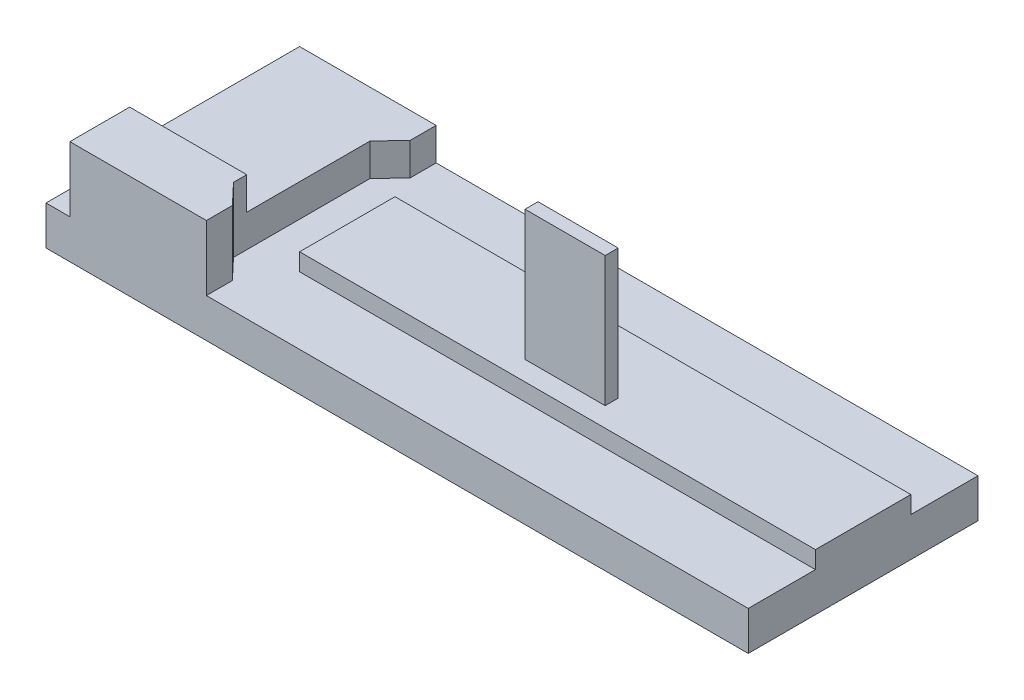
ISO-10303-21;
HEADER;
FILE_DESCRIPTION(('STEP AP214'),'2;1');
FILE_NAME('part.step','',(''),(''),'','','');
FILE_SCHEMA(('AUTOMOTIVE_DESIGN { 1 0 10303 214 1 1 1 1 }'));
ENDSEC;
DATA;
#1=APPLICATION_CONTEXT('core data for automotive mechanical design processes');
#2=APPLICATION_PROTOCOL_DEFINITION('international standard','automotive_design',2000,#1);
#3=PRODUCT_CONTEXT('',#1,'mechanical');
#4=PRODUCT('Part','Part','',(#3));
#5=PRODUCT_RELATED_PRODUCT_CATEGORY('part','',(#4));
#6=PRODUCT_DEFINITION_FORMATION('','',#4);
#7=PRODUCT_DEFINITION_CONTEXT('part definition',#1,'design');
#8=PRODUCT_DEFINITION('design','',#6,#7);
#9=PRODUCT_DEFINITION_SHAPE('','',#8);
#10=(LENGTH_UNIT() NAMED_UNIT(*) SI_UNIT(.MILLI.,.METRE.));
#11=(NAMED_UNIT(*) PLANE_ANGLE_UNIT() SI_UNIT($,.RADIAN.));
#12=(NAMED_UNIT(*) SI_UNIT($,.STERADIAN.) SOLID_ANGLE_UNIT());
#13=UNCERTAINTY_MEASURE_WITH_UNIT(LENGTH_MEASURE(1.E-05),#10,'distance_accuracy_value','');
#14=(GEOMETRIC_REPRESENTATION_CONTEXT(3) GLOBAL_UNCERTAINTY_ASSIGNED_CONTEXT((#13)) GLOBAL_UNIT_ASSIGNED_CONTEXT((#10,
#11,#12)) REPRESENTATION_CONTEXT('',''));
#15=CARTESIAN_POINT('',(0.,0.,0.));
#16=DIRECTION('',(0.,0.,1.));
#17=DIRECTION('',(1.,0.,0.));
#18=AXIS2_PLACEMENT_3D('',#15,#16,#17);
#19=CARTESIAN_POINT('',(0.,13.,0.));
#20=DIRECTION('',(0.,-1.,0.));
#21=DIRECTION('',(0.,0.,-1.));
#22=AXIS2_PLACEMENT_3D('',#19,#20,#21);
#23=PLANE('',#22);
#24=DIRECTION('',(0.,0.,-1.));
#25=VECTOR('',#24,1.);
#26=CARTESIAN_POINT('',(81.,13.,-11.));
#27=LINE('',#26,#25);
#28=CARTESIAN_POINT('',(81.,13.,11.));
#29=VERTEX_POINT('',#28);
#30=CARTESIAN_POINT('',(81.,13.,-11.));
#31=VERTEX_POINT('',#30);
#32=EDGE_CURVE('E230',#29,#31,#27,.T.);
#33=ORIENTED_EDGE('',*,*,#32,.T.);
#34=DIRECTION('',(-1.,0.,0.));
#35=VECTOR('',#34,1.);
#36=CARTESIAN_POINT('',(81.,13.,-11.));
#37=LINE('',#36,#35);
#38=CARTESIAN_POINT('',(-38.,13.,-11.));
#39=VERTEX_POINT('',#38);
#40=EDGE_CURVE('E234',#31,#39,#37,.T.);
#41=ORIENTED_EDGE('',*,*,#40,.T.);
#42=DIRECTION('',(0.,0.,1.));
#43=VECTOR('',#42,1.);
#44=CARTESIAN_POINT('',(-38.,13.,-11.));
#45=LINE('',#44,#43);
#46=CARTESIAN_POINT('',(-38.,13.,11.));
#47=VERTEX_POINT('',#46);
#48=EDGE_CURVE('E238',#39,#47,#45,.T.);
#49=ORIENTED_EDGE('',*,*,#48,.T.);
#50=DIRECTION('',(1.,0.,0.));
#51=VECTOR('',#50,1.);
#52=CARTESIAN_POINT('',(81.,13.,11.));
#53=LINE('',#52,#51);
#54=EDGE_CURVE('E241',#47,#29,#53,.T.);
#55=ORIENTED_EDGE('',*,*,#54,.T.);
#56=EDGE_LOOP('',(#33,#41,#49,#55));
#57=FACE_BOUND('',#56,.T.);
#58=DIRECTION('',(0.,0.,1.));
#59=VECTOR('',#58,1.);
#60=CARTESIAN_POINT('',(9.50000000000002,13.,3.5));
#61=LINE('',#60,#59);
#62=CARTESIAN_POINT('',(9.50000000000002,13.,3.5));
#63=VERTEX_POINT('',#62);
#64=CARTESIAN_POINT('',(9.50000000000002,13.,6.5));
#65=VERTEX_POINT('',#64);
#66=EDGE_CURVE('E217',#63,#65,#61,.T.);
#67=ORIENTED_EDGE('',*,*,#66,.F.);
#68=DIRECTION('',(-1.,0.,0.));
#69=VECTOR('',#68,1.);
#70=CARTESIAN_POINT('',(9.50000000000002,13.,3.5));
#71=LINE('',#70,#69);
#72=CARTESIAN_POINT('',(28.,13.,3.5));
#73=VERTEX_POINT('',#72);
#74=EDGE_CURVE('E214',#73,#63,#71,.T.);
#75=ORIENTED_EDGE('',*,*,#74,.F.);
#76=DIRECTION('',(0.,0.,-1.));
#77=VECTOR('',#76,1.);
#78=CARTESIAN_POINT('',(28.,13.,3.5));
#79=LINE('',#78,#77);
#80=CARTESIAN_POINT('',(28.,13.,6.5));
#81=VERTEX_POINT('',#80);
#82=EDGE_CURVE('E66',#81,#73,#79,.T.);
#83=ORIENTED_EDGE('',*,*,#82,.F.);
#84=DIRECTION('',(1.,0.,0.));
#85=VECTOR('',#84,1.);
#86=CARTESIAN_POINT('',(9.50000000000002,13.,6.5));
#87=LINE('',#86,#85);
#88=EDGE_CURVE('E61',#65,#81,#87,.T.);
#89=ORIENTED_EDGE('',*,*,#88,.F.);
#90=EDGE_LOOP('',(#67,#75,#83,#89));
#91=FACE_BOUND('',#90,.T.);
#92=ADVANCED_FACE('F45',(#57,#91),#23,.F.);
#93=CARTESIAN_POINT('',(0.,9.,0.));
#94=DIRECTION('',(0.,-1.,0.));
#95=DIRECTION('',(0.,0.,-1.));
#96=AXIS2_PLACEMENT_3D('',#93,#94,#95);
#97=PLANE('',#96);
#98=DIRECTION('',(-1.,0.,0.));
#99=VECTOR('',#98,1.);
#100=CARTESIAN_POINT('',(81.,9.,-11.));
#101=LINE('',#100,#99);
#102=CARTESIAN_POINT('',(81.,9.,-11.));
#103=VERTEX_POINT('',#102);
#104=CARTESIAN_POINT('',(-38.,9.,-11.));
#105=VERTEX_POINT('',#104);
#106=EDGE_CURVE('E219',#103,#105,#101,.T.);
#107=ORIENTED_EDGE('',*,*,#106,.F.);
#108=DIRECTION('',(0.,0.,-1.));
#109=VECTOR('',#108,1.);
#110=CARTESIAN_POINT('',(81.,9.,26.5));
#111=LINE('',#110,#109);
#112=CARTESIAN_POINT('',(81.,9.,-26.5));
#113=VERTEX_POINT('',#112);
#114=EDGE_CURVE('E372',#103,#113,#111,.T.);
#115=ORIENTED_EDGE('',*,*,#114,.T.);
#116=DIRECTION('',(-1.,0.,0.));
#117=VECTOR('',#116,1.);
#118=CARTESIAN_POINT('',(-81.,9.,-26.5));
#119=LINE('',#118,#117);
#120=CARTESIAN_POINT('',(-44.,9.,-26.5));
#121=VERTEX_POINT('',#120);
#122=EDGE_CURVE('E373',#113,#121,#119,.T.);
#123=ORIENTED_EDGE('',*,*,#122,.T.);
#124=DIRECTION('',(0.,0.,-1.));
#125=VECTOR('',#124,1.);
#126=CARTESIAN_POINT('',(-44.,9.,-20.5));
#127=LINE('',#126,#125);
#128=CARTESIAN_POINT('',(-44.,9.,-20.5));
#129=VERTEX_POINT('',#128);
#130=EDGE_CURVE('E304',#129,#121,#127,.T.);
#131=ORIENTED_EDGE('',*,*,#130,.F.);
#132=DIRECTION('',(0.687744647910783,0.,-0.725952683905827));
#133=VECTOR('',#132,1.);
#134=CARTESIAN_POINT('',(-48.5,9.,-15.75));
#135=LINE('',#134,#133);
#136=CARTESIAN_POINT('',(-48.5,9.,-15.75));
#137=VERTEX_POINT('',#136);
#138=EDGE_CURVE('E333',#137,#129,#135,.T.);
#139=ORIENTED_EDGE('',*,*,#138,.F.);
#140=DIRECTION('',(0.,0.,-1.));
#141=VECTOR('',#140,1.);
#142=CARTESIAN_POINT('',(-48.5,9.,15.75));
#143=LINE('',#142,#141);
#144=CARTESIAN_POINT('',(-48.5,9.,15.75));
#145=VERTEX_POINT('',#144);
#146=EDGE_CURVE('E329',#145,#137,#143,.T.);
#147=ORIENTED_EDGE('',*,*,#146,.F.);
#148=DIRECTION('',(-0.687744647910783,0.,-0.725952683905827));
#149=VECTOR('',#148,1.);
#150=CARTESIAN_POINT('',(-48.5,9.,15.75));
#151=LINE('',#150,#149);
#152=CARTESIAN_POINT('',(-44.,9.,20.5));
#153=VERTEX_POINT('',#152);
#154=EDGE_CURVE('E325',#153,#145,#151,.T.);
#155=ORIENTED_EDGE('',*,*,#154,.F.);
#156=DIRECTION('',(0.,0.,-1.));
#157=VECTOR('',#156,1.);
#158=CARTESIAN_POINT('',(-44.,9.,20.5));
#159=LINE('',#158,#157);
#160=CARTESIAN_POINT('',(-44.,9.,26.5));
#161=VERTEX_POINT('',#160);
#162=EDGE_CURVE('E321',#161,#153,#159,.T.);
#163=ORIENTED_EDGE('',*,*,#162,.F.);
#164=DIRECTION('',(1.,0.,0.));
#165=VECTOR('',#164,1.);
#166=CARTESIAN_POINT('',(-81.,9.,26.5));
#167=LINE('',#166,#165);
#168=CARTESIAN_POINT('',(81.,9.,26.5));
#169=VERTEX_POINT('',#168);
#170=EDGE_CURVE('E380',#161,#169,#167,.T.);
#171=ORIENTED_EDGE('',*,*,#170,.T.);
#172=CARTESIAN_POINT('',(81.,9.,11.));
#173=VERTEX_POINT('',#172);
#174=EDGE_CURVE('E368',#169,#173,#111,.T.);
#175=ORIENTED_EDGE('',*,*,#174,.T.);
#176=DIRECTION('',(1.,0.,0.));
#177=VECTOR('',#176,1.);
#178=CARTESIAN_POINT('',(81.,9.,11.));
#179=LINE('',#178,#177);
#180=CARTESIAN_POINT('',(-38.,9.,11.));
#181=VERTEX_POINT('',#180);
#182=EDGE_CURVE('E235',#181,#173,#179,.T.);
#183=ORIENTED_EDGE('',*,*,#182,.F.);
#184=DIRECTION('',(0.,0.,1.));
#185=VECTOR('',#184,1.);
#186=CARTESIAN_POINT('',(-38.,9.,-11.));
#187=LINE('',#186,#185);
#188=EDGE_CURVE('E224',#105,#181,#187,.T.);
#189=ORIENTED_EDGE('',*,*,#188,.F.);
#190=EDGE_LOOP('',(#107,#115,#123,#131,#139,#147,#155,#163,#171,#175,#183,#189));
#191=FACE_BOUND('',#190,.T.);
#192=ADVANCED_FACE('F433',(#191),#97,.F.);
#193=DIRECTION('',(0.,0.,1.));
#194=VECTOR('',#193,1.);
#195=CARTESIAN_POINT('',(-75.5,9.,-26.5));
#196=LINE('',#195,#194);
#197=CARTESIAN_POINT('',(-75.5,9.,-26.5));
#198=VERTEX_POINT('',#197);
#199=CARTESIAN_POINT('',(-75.5,9.,26.5));
#200=VERTEX_POINT('',#199);
#201=EDGE_CURVE('E299',#198,#200,#196,.T.);
#202=ORIENTED_EDGE('',*,*,#201,.F.);
#203=CARTESIAN_POINT('',(-81.,9.,-26.5));
#204=VERTEX_POINT('',#203);
#205=EDGE_CURVE('E371',#198,#204,#119,.T.);
#206=ORIENTED_EDGE('',*,*,#205,.T.);
#207=DIRECTION('',(0.,0.,1.));
#208=VECTOR('',#207,1.);
#209=CARTESIAN_POINT('',(-81.,9.,26.5));
#210=LINE('',#209,#208);
#211=CARTESIAN_POINT('',(-81.,9.,26.5));
#212=VERTEX_POINT('',#211);
#213=EDGE_CURVE('E377',#204,#212,#210,.T.);
#214=ORIENTED_EDGE('',*,*,#213,.T.);
#215=EDGE_CURVE('E381',#212,#200,#167,.T.);
#216=ORIENTED_EDGE('',*,*,#215,.T.);
#217=EDGE_LOOP('',(#202,#206,#214,#216));
#218=FACE_BOUND('',#217,.T.);
#219=ADVANCED_FACE('F551',(#218),#97,.F.);
#220=CARTESIAN_POINT('',(81.,9.,26.5));
#221=DIRECTION('',(-1.,0.,0.));
#222=DIRECTION('',(0.,0.,1.));
#223=AXIS2_PLACEMENT_3D('',#220,#221,#222);
#224=PLANE('',#223);
#225=DIRECTION('',(0.,0.,-1.));
#226=VECTOR('',#225,1.);
#227=CARTESIAN_POINT('',(81.,0.,26.5));
#228=LINE('',#227,#226);
#229=CARTESIAN_POINT('',(81.,0.,26.5));
#230=VERTEX_POINT('',#229);
#231=CARTESIAN_POINT('',(81.,0.,-26.5));
#232=VERTEX_POINT('',#231);
#233=EDGE_CURVE('E367',#230,#232,#228,.T.);
#234=ORIENTED_EDGE('',*,*,#233,.T.);
#235=DIRECTION('',(0.,-1.,0.));
#236=VECTOR('',#235,1.);
#237=CARTESIAN_POINT('',(81.,9.,-26.5));
#238=LINE('',#237,#236);
#239=EDGE_CURVE('E408',#113,#232,#238,.T.);
#240=ORIENTED_EDGE('',*,*,#239,.F.);
#241=ORIENTED_EDGE('',*,*,#114,.F.);
#242=DIRECTION('',(0.,-1.,0.));
#243=VECTOR('',#242,1.);
#244=CARTESIAN_POINT('',(81.,13.,-11.));
#245=LINE('',#244,#243);
#246=EDGE_CURVE('E262',#31,#103,#245,.T.);
#247=ORIENTED_EDGE('',*,*,#246,.F.);
#248=ORIENTED_EDGE('',*,*,#32,.F.);
#249=DIRECTION('',(0.,-1.,0.));
#250=VECTOR('',#249,1.);
#251=CARTESIAN_POINT('',(81.,13.,11.));
#252=LINE('',#251,#250);
#253=EDGE_CURVE('E243',#29,#173,#252,.T.);
#254=ORIENTED_EDGE('',*,*,#253,.T.);
#255=ORIENTED_EDGE('',*,*,#174,.F.);
#256=DIRECTION('',(0.,-1.,0.));
#257=VECTOR('',#256,1.);
#258=CARTESIAN_POINT('',(81.,9.,26.5));
#259=LINE('',#258,#257);
#260=EDGE_CURVE('E384',#169,#230,#259,.T.);
#261=ORIENTED_EDGE('',*,*,#260,.T.);
#262=EDGE_LOOP('',(#234,#240,#241,#247,#248,#254,#255,#261));
#263=FACE_BOUND('',#262,.T.);
#264=ADVANCED_FACE('F47',(#263),#224,.F.);
#265=CARTESIAN_POINT('',(-81.,9.,-26.5));
#266=DIRECTION('',(0.,0.,1.));
#267=DIRECTION('',(1.,0.,0.));
#268=AXIS2_PLACEMENT_3D('',#265,#266,#267);
#269=PLANE('',#268);
#270=DIRECTION('',(0.,-1.,0.));
#271=VECTOR('',#270,1.);
#272=CARTESIAN_POINT('',(-75.5,24.,-26.5));
#273=LINE('',#272,#271);
#274=CARTESIAN_POINT('',(-75.5,16.5,-26.5));
#275=VERTEX_POINT('',#274);
#276=EDGE_CURVE('E364',#275,#198,#273,.T.);
#277=ORIENTED_EDGE('',*,*,#276,.F.);
#278=DIRECTION('',(-1.,0.,0.));
#279=VECTOR('',#278,1.);
#280=CARTESIAN_POINT('',(81.,16.5,-26.5));
#281=LINE('',#280,#279);
#282=CARTESIAN_POINT('',(-44.,16.5,-26.5));
#283=VERTEX_POINT('',#282);
#284=EDGE_CURVE('E281',#283,#275,#281,.T.);
#285=ORIENTED_EDGE('',*,*,#284,.F.);
#286=DIRECTION('',(0.,-1.,0.));
#287=VECTOR('',#286,1.);
#288=CARTESIAN_POINT('',(-44.,24.,-26.5));
#289=LINE('',#288,#287);
#290=EDGE_CURVE('E317',#283,#121,#289,.T.);
#291=ORIENTED_EDGE('',*,*,#290,.T.);
#292=ORIENTED_EDGE('',*,*,#122,.F.);
#293=ORIENTED_EDGE('',*,*,#239,.T.);
#294=DIRECTION('',(-1.,0.,0.));
#295=VECTOR('',#294,1.);
#296=CARTESIAN_POINT('',(-81.,0.,-26.5));
#297=LINE('',#296,#295);
#298=CARTESIAN_POINT('',(-81.,0.,-26.5));
#299=VERTEX_POINT('',#298);
#300=EDGE_CURVE('E388',#232,#299,#297,.T.);
#301=ORIENTED_EDGE('',*,*,#300,.T.);
#302=DIRECTION('',(0.,-1.,0.));
#303=VECTOR('',#302,1.);
#304=CARTESIAN_POINT('',(-81.,9.,-26.5));
#305=LINE('',#304,#303);
#306=EDGE_CURVE('E404',#204,#299,#305,.T.);
#307=ORIENTED_EDGE('',*,*,#306,.F.);
#308=ORIENTED_EDGE('',*,*,#205,.F.);
#309=EDGE_LOOP('',(#277,#285,#291,#292,#293,#301,#307,#308));
#310=FACE_BOUND('',#309,.T.);
#311=ADVANCED_FACE('F447',(#310),#269,.F.);
#312=CARTESIAN_POINT('',(-81.,9.,26.5));
#313=DIRECTION('',(1.,0.,0.));
#314=DIRECTION('',(0.,0.,-1.));
#315=AXIS2_PLACEMENT_3D('',#312,#313,#314);
#316=PLANE('',#315);
#317=DIRECTION('',(0.,0.,1.));
#318=VECTOR('',#317,1.);
#319=CARTESIAN_POINT('',(-81.,0.,26.5));
#320=LINE('',#319,#318);
#321=CARTESIAN_POINT('',(-81.,0.,26.5));
#322=VERTEX_POINT('',#321);
#323=EDGE_CURVE('E391',#299,#322,#320,.T.);
#324=ORIENTED_EDGE('',*,*,#323,.T.);
#325=DIRECTION('',(0.,-1.,0.));
#326=VECTOR('',#325,1.);
#327=CARTESIAN_POINT('',(-81.,9.,26.5));
#328=LINE('',#327,#326);
#329=EDGE_CURVE('E400',#212,#322,#328,.T.);
#330=ORIENTED_EDGE('',*,*,#329,.F.);
#331=ORIENTED_EDGE('',*,*,#213,.F.);
#332=ORIENTED_EDGE('',*,*,#306,.T.);
#333=EDGE_LOOP('',(#324,#330,#331,#332));
#334=FACE_BOUND('',#333,.T.);
#335=ADVANCED_FACE('F557',(#334),#316,.F.);
#336=CARTESIAN_POINT('',(-81.,9.,26.5));
#337=DIRECTION('',(0.,0.,-1.));
#338=DIRECTION('',(-1.,0.,0.));
#339=AXIS2_PLACEMENT_3D('',#336,#337,#338);
#340=PLANE('',#339);
#341=DIRECTION('',(1.,0.,0.));
#342=VECTOR('',#341,1.);
#343=CARTESIAN_POINT('',(-81.,0.,26.5));
#344=LINE('',#343,#342);
#345=EDGE_CURVE('E394',#322,#230,#344,.T.);
#346=ORIENTED_EDGE('',*,*,#345,.T.);
#347=ORIENTED_EDGE('',*,*,#260,.F.);
#348=ORIENTED_EDGE('',*,*,#170,.F.);
#349=DIRECTION('',(0.,-1.,0.));
#350=VECTOR('',#349,1.);
#351=CARTESIAN_POINT('',(-44.,24.,26.5));
#352=LINE('',#351,#350);
#353=CARTESIAN_POINT('',(-44.,24.,26.5));
#354=VERTEX_POINT('',#353);
#355=EDGE_CURVE('E356',#354,#161,#352,.T.);
#356=ORIENTED_EDGE('',*,*,#355,.F.);
#357=DIRECTION('',(1.,0.,0.));
#358=VECTOR('',#357,1.);
#359=CARTESIAN_POINT('',(-44.,24.,26.5));
#360=LINE('',#359,#358);
#361=CARTESIAN_POINT('',(-75.5,24.,26.5));
#362=VERTEX_POINT('',#361);
#363=EDGE_CURVE('E303',#362,#354,#360,.T.);
#364=ORIENTED_EDGE('',*,*,#363,.F.);
#365=DIRECTION('',(0.,-1.,0.));
#366=VECTOR('',#365,1.);
#367=CARTESIAN_POINT('',(-75.5,24.,26.5));
#368=LINE('',#367,#366);
#369=EDGE_CURVE('E360',#362,#200,#368,.T.);
#370=ORIENTED_EDGE('',*,*,#369,.T.);
#371=ORIENTED_EDGE('',*,*,#215,.F.);
#372=ORIENTED_EDGE('',*,*,#329,.T.);
#373=EDGE_LOOP('',(#346,#347,#348,#356,#364,#370,#371,#372));
#374=FACE_BOUND('',#373,.T.);
#375=ADVANCED_FACE('F459',(#374),#340,.F.);
#376=CARTESIAN_POINT('',(0.,0.,0.));
#377=DIRECTION('',(0.,-1.,0.));
#378=DIRECTION('',(0.,0.,-1.));
#379=AXIS2_PLACEMENT_3D('',#376,#377,#378);
#380=PLANE('',#379);
#381=ORIENTED_EDGE('',*,*,#233,.F.);
#382=ORIENTED_EDGE('',*,*,#345,.F.);
#383=ORIENTED_EDGE('',*,*,#323,.F.);
#384=ORIENTED_EDGE('',*,*,#300,.F.);
#385=EDGE_LOOP('',(#381,#382,#383,#384));
#386=FACE_BOUND('',#385,.T.);
#387=ADVANCED_FACE('F547',(#386),#380,.T.);
#388=CARTESIAN_POINT('',(-75.5,24.,-26.5));
#389=DIRECTION('',(1.,0.,0.));
#390=DIRECTION('',(0.,0.,-1.));
#391=AXIS2_PLACEMENT_3D('',#388,#389,#390);
#392=PLANE('',#391);
#393=CARTESIAN_POINT('',(-75.5,16.5175631474597,19.5984697974364));
#394=DIRECTION('',(-1.,0.,0.));
#395=DIRECTION('',(0.,0.,1.));
#396=AXIS2_PLACEMENT_3D('',#393,#394,#395);
#397=CIRCLE('',#396,3.25);
#398=CARTESIAN_POINT('',(-75.5,16.5175631474597,22.8484697974364));
#399=VERTEX_POINT('',#398);
#400=EDGE_CURVE('E266',#399,#399,#397,.T.);
#401=ORIENTED_EDGE('',*,*,#400,.F.);
#402=EDGE_LOOP('',(#401));
#403=FACE_BOUND('',#402,.T.);
#404=DIRECTION('',(0.,0.,1.));
#405=VECTOR('',#404,1.);
#406=CARTESIAN_POINT('',(-75.5,24.,-26.5));
#407=LINE('',#406,#405);
#408=CARTESIAN_POINT('',(-75.5,24.,12.6969395948728));
#409=VERTEX_POINT('',#408);
#410=EDGE_CURVE('E300',#409,#362,#407,.T.);
#411=ORIENTED_EDGE('',*,*,#410,.F.);
#412=DIRECTION('',(0.,1.,0.));
#413=VECTOR('',#412,1.);
#414=CARTESIAN_POINT('',(-75.5,24.,12.6969395948728));
#415=LINE('',#414,#413);
#416=CARTESIAN_POINT('',(-75.5,16.5,12.6969395948728));
#417=VERTEX_POINT('',#416);
#418=EDGE_CURVE('E271',#417,#409,#415,.T.);
#419=ORIENTED_EDGE('',*,*,#418,.F.);
#420=DIRECTION('',(0.,0.,1.));
#421=VECTOR('',#420,1.);
#422=CARTESIAN_POINT('',(-75.5,16.5,12.6969395948728));
#423=LINE('',#422,#421);
#424=EDGE_CURVE('E277',#275,#417,#423,.T.);
#425=ORIENTED_EDGE('',*,*,#424,.F.);
#426=ORIENTED_EDGE('',*,*,#276,.T.);
#427=ORIENTED_EDGE('',*,*,#201,.T.);
#428=ORIENTED_EDGE('',*,*,#369,.F.);
#429=EDGE_LOOP('',(#411,#419,#425,#426,#427,#428));
#430=FACE_BOUND('',#429,.T.);
#431=ADVANCED_FACE('F543',(#403,#430),#392,.F.);
#432=CARTESIAN_POINT('',(-44.,24.,20.5));
#433=DIRECTION('',(-1.,0.,0.));
#434=DIRECTION('',(0.,0.,1.));
#435=AXIS2_PLACEMENT_3D('',#432,#433,#434);
#436=PLANE('',#435);
#437=ORIENTED_EDGE('',*,*,#162,.T.);
#438=DIRECTION('',(0.,-1.,0.));
#439=VECTOR('',#438,1.);
#440=CARTESIAN_POINT('',(-44.,24.,20.5));
#441=LINE('',#440,#439);
#442=CARTESIAN_POINT('',(-44.,24.,20.5));
#443=VERTEX_POINT('',#442);
#444=EDGE_CURVE('E352',#443,#153,#441,.T.);
#445=ORIENTED_EDGE('',*,*,#444,.F.);
#446=DIRECTION('',(0.,0.,-1.));
#447=VECTOR('',#446,1.);
#448=CARTESIAN_POINT('',(-44.,24.,20.5));
#449=LINE('',#448,#447);
#450=EDGE_CURVE('E307',#354,#443,#449,.T.);
#451=ORIENTED_EDGE('',*,*,#450,.F.);
#452=ORIENTED_EDGE('',*,*,#355,.T.);
#453=EDGE_LOOP('',(#437,#445,#451,#452));
#454=FACE_BOUND('',#453,.T.);
#455=ADVANCED_FACE('F540',(#454),#436,.F.);
#456=CARTESIAN_POINT('',(-48.5,24.,15.75));
#457=DIRECTION('',(-0.725952683905827,0.,0.687744647910783));
#458=DIRECTION('',(0.687744647910783,0.,0.725952683905827));
#459=AXIS2_PLACEMENT_3D('',#456,#457,#458);
#460=PLANE('',#459);
#461=ORIENTED_EDGE('',*,*,#154,.T.);
#462=DIRECTION('',(0.,-1.,0.));
#463=VECTOR('',#462,1.);
#464=CARTESIAN_POINT('',(-48.5,24.,15.75));
#465=LINE('',#464,#463);
#466=CARTESIAN_POINT('',(-48.5,24.,15.75));
#467=VERTEX_POINT('',#466);
#468=EDGE_CURVE('E348',#467,#145,#465,.T.);
#469=ORIENTED_EDGE('',*,*,#468,.F.);
#470=DIRECTION('',(-0.687744647910783,0.,-0.725952683905827));
#471=VECTOR('',#470,1.);
#472=CARTESIAN_POINT('',(-48.5,24.,15.75));
#473=LINE('',#472,#471);
#474=EDGE_CURVE('E310',#443,#467,#473,.T.);
#475=ORIENTED_EDGE('',*,*,#474,.F.);
#476=ORIENTED_EDGE('',*,*,#444,.T.);
#477=EDGE_LOOP('',(#461,#469,#475,#476));
#478=FACE_BOUND('',#477,.T.);
#479=ADVANCED_FACE('F429',(#478),#460,.F.);
#480=CARTESIAN_POINT('',(-48.5,24.,15.75));
#481=DIRECTION('',(-1.,0.,0.));
#482=DIRECTION('',(0.,0.,1.));
#483=AXIS2_PLACEMENT_3D('',#480,#481,#482);
#484=PLANE('',#483);
#485=DIRECTION('',(0.,0.,1.));
#486=VECTOR('',#485,1.);
#487=CARTESIAN_POINT('',(-48.5,16.5,15.75));
#488=LINE('',#487,#486);
#489=CARTESIAN_POINT('',(-48.5,16.5,-15.75));
#490=VERTEX_POINT('',#489);
#491=CARTESIAN_POINT('',(-48.5,16.5,12.6969395948728));
#492=VERTEX_POINT('',#491);
#493=EDGE_CURVE('E295',#490,#492,#488,.T.);
#494=ORIENTED_EDGE('',*,*,#493,.T.);
#495=DIRECTION('',(0.,1.,0.));
#496=VECTOR('',#495,1.);
#497=CARTESIAN_POINT('',(-48.5,24.,12.6969395948728));
#498=LINE('',#497,#496);
#499=CARTESIAN_POINT('',(-48.5,24.,12.6969395948728));
#500=VERTEX_POINT('',#499);
#501=EDGE_CURVE('E285',#492,#500,#498,.T.);
#502=ORIENTED_EDGE('',*,*,#501,.T.);
#503=DIRECTION('',(0.,0.,-1.));
#504=VECTOR('',#503,1.);
#505=CARTESIAN_POINT('',(-48.5,24.,15.75));
#506=LINE('',#505,#504);
#507=EDGE_CURVE('E313',#467,#500,#506,.T.);
#508=ORIENTED_EDGE('',*,*,#507,.F.);
#509=ORIENTED_EDGE('',*,*,#468,.T.);
#510=ORIENTED_EDGE('',*,*,#146,.T.);
#511=DIRECTION('',(0.,-1.,0.));
#512=VECTOR('',#511,1.);
#513=CARTESIAN_POINT('',(-48.5,24.,-15.75));
#514=LINE('',#513,#512);
#515=EDGE_CURVE('E345',#490,#137,#514,.T.);
#516=ORIENTED_EDGE('',*,*,#515,.F.);
#517=EDGE_LOOP('',(#494,#502,#508,#509,#510,#516));
#518=FACE_BOUND('',#517,.T.);
#519=ADVANCED_FACE('F421',(#518),#484,.F.);
#520=CARTESIAN_POINT('',(-48.5,24.,-15.75));
#521=DIRECTION('',(-0.725952683905827,0.,-0.687744647910783));
#522=DIRECTION('',(-0.687744647910783,0.,0.725952683905827));
#523=AXIS2_PLACEMENT_3D('',#520,#521,#522);
#524=PLANE('',#523);
#525=DIRECTION('',(0.,-1.,0.));
#526=VECTOR('',#525,1.);
#527=CARTESIAN_POINT('',(-44.,24.,-20.5));
#528=LINE('',#527,#526);
#529=CARTESIAN_POINT('',(-44.,16.5,-20.5));
#530=VERTEX_POINT('',#529);
#531=EDGE_CURVE('E342',#530,#129,#528,.T.);
#532=ORIENTED_EDGE('',*,*,#531,.F.);
#533=DIRECTION('',(-0.687744647910783,0.,0.725952683905827));
#534=VECTOR('',#533,1.);
#535=CARTESIAN_POINT('',(-48.5,16.5,-15.75));
#536=LINE('',#535,#534);
#537=EDGE_CURVE('E291',#530,#490,#536,.T.);
#538=ORIENTED_EDGE('',*,*,#537,.T.);
#539=ORIENTED_EDGE('',*,*,#515,.T.);
#540=ORIENTED_EDGE('',*,*,#138,.T.);
#541=EDGE_LOOP('',(#532,#538,#539,#540));
#542=FACE_BOUND('',#541,.T.);
#543=ADVANCED_FACE('F437',(#542),#524,.F.);
#544=CARTESIAN_POINT('',(-44.,24.,-20.5));
#545=DIRECTION('',(-1.,0.,0.));
#546=DIRECTION('',(0.,0.,1.));
#547=AXIS2_PLACEMENT_3D('',#544,#545,#546);
#548=PLANE('',#547);
#549=ORIENTED_EDGE('',*,*,#290,.F.);
#550=DIRECTION('',(0.,0.,1.));
#551=VECTOR('',#550,1.);
#552=CARTESIAN_POINT('',(-44.,16.5,-20.5));
#553=LINE('',#552,#551);
#554=EDGE_CURVE('E11',#283,#530,#553,.T.);
#555=ORIENTED_EDGE('',*,*,#554,.T.);
#556=ORIENTED_EDGE('',*,*,#531,.T.);
#557=ORIENTED_EDGE('',*,*,#130,.T.);
#558=EDGE_LOOP('',(#549,#555,#556,#557));
#559=FACE_BOUND('',#558,.T.);
#560=ADVANCED_FACE('F443',(#559),#548,.F.);
#561=CARTESIAN_POINT('',(0.,24.,0.));
#562=DIRECTION('',(0.,1.,0.));
#563=DIRECTION('',(0.,0.,1.));
#564=AXIS2_PLACEMENT_3D('',#561,#562,#563);
#565=PLANE('',#564);
#566=DIRECTION('',(1.,0.,0.));
#567=VECTOR('',#566,1.);
#568=CARTESIAN_POINT('',(0.,24.,12.6969395948728));
#569=LINE('',#568,#567);
#570=EDGE_CURVE('E54',#409,#500,#569,.T.);
#571=ORIENTED_EDGE('',*,*,#570,.F.);
#572=ORIENTED_EDGE('',*,*,#410,.T.);
#573=ORIENTED_EDGE('',*,*,#363,.T.);
#574=ORIENTED_EDGE('',*,*,#450,.T.);
#575=ORIENTED_EDGE('',*,*,#474,.T.);
#576=ORIENTED_EDGE('',*,*,#507,.T.);
#577=EDGE_LOOP('',(#571,#572,#573,#574,#575,#576));
#578=FACE_BOUND('',#577,.T.);
#579=ADVANCED_FACE('F423',(#578),#565,.T.);
#580=CARTESIAN_POINT('',(81.,16.5,12.6969395948728));
#581=DIRECTION('',(0.,-1.,0.));
#582=DIRECTION('',(0.,0.,-1.));
#583=AXIS2_PLACEMENT_3D('',#580,#581,#582);
#584=PLANE('',#583);
#585=ORIENTED_EDGE('',*,*,#537,.F.);
#586=ORIENTED_EDGE('',*,*,#554,.F.);
#587=ORIENTED_EDGE('',*,*,#284,.T.);
#588=ORIENTED_EDGE('',*,*,#424,.T.);
#589=DIRECTION('',(-1.,0.,0.));
#590=VECTOR('',#589,1.);
#591=CARTESIAN_POINT('',(81.,16.5,12.6969395948728));
#592=LINE('',#591,#590);
#593=EDGE_CURVE('E282',#492,#417,#592,.T.);
#594=ORIENTED_EDGE('',*,*,#593,.F.);
#595=ORIENTED_EDGE('',*,*,#493,.F.);
#596=EDGE_LOOP('',(#585,#586,#587,#588,#594,#595));
#597=FACE_BOUND('',#596,.T.);
#598=ADVANCED_FACE('F439',(#597),#584,.F.);
#599=CARTESIAN_POINT('',(81.,24.,12.6969395948728));
#600=DIRECTION('',(0.,0.,1.));
#601=DIRECTION('',(1.,0.,0.));
#602=AXIS2_PLACEMENT_3D('',#599,#600,#601);
#603=PLANE('',#602);
#604=ORIENTED_EDGE('',*,*,#593,.T.);
#605=ORIENTED_EDGE('',*,*,#418,.T.);
#606=ORIENTED_EDGE('',*,*,#570,.T.);
#607=ORIENTED_EDGE('',*,*,#501,.F.);
#608=EDGE_LOOP('',(#604,#605,#606,#607));
#609=FACE_BOUND('',#608,.T.);
#610=ADVANCED_FACE('F414',(#609),#603,.F.);
#611=CARTESIAN_POINT('',(-60.5,16.5175631474597,19.5984697974364));
#612=DIRECTION('',(-1.,0.,0.));
#613=DIRECTION('',(0.,0.,1.));
#614=AXIS2_PLACEMENT_3D('',#611,#612,#613);
#615=CYLINDRICAL_SURFACE('',#614,3.25);
#616=CARTESIAN_POINT('',(-60.5,16.5175631474597,19.5984697974364));
#617=DIRECTION('',(-1.,0.,0.));
#618=DIRECTION('',(0.,0.,1.));
#619=AXIS2_PLACEMENT_3D('',#616,#617,#618);
#620=CIRCLE('',#619,3.25);
#621=CARTESIAN_POINT('',(-60.5,16.5175631474597,22.8484697974364));
#622=VERTEX_POINT('',#621);
#623=EDGE_CURVE('E267',#622,#622,#620,.T.);
#624=ORIENTED_EDGE('',*,*,#623,.F.);
#625=EDGE_LOOP('',(#624));
#626=FACE_BOUND('',#625,.T.);
#627=ORIENTED_EDGE('',*,*,#400,.T.);
#628=EDGE_LOOP('',(#627));
#629=FACE_BOUND('',#628,.T.);
#630=ADVANCED_FACE('F521',(#626,#629),#615,.F.);
#631=CARTESIAN_POINT('',(-60.5,16.5175631474597,19.5984697974364));
#632=DIRECTION('',(-1.,0.,0.));
#633=DIRECTION('',(0.,0.,1.));
#634=AXIS2_PLACEMENT_3D('',#631,#632,#633);
#635=PLANE('',#634);
#636=ORIENTED_EDGE('',*,*,#623,.T.);
#637=EDGE_LOOP('',(#636));
#638=FACE_BOUND('',#637,.T.);
#639=ADVANCED_FACE('F518',(#638),#635,.T.);
#640=CARTESIAN_POINT('',(81.,13.,-11.));
#641=DIRECTION('',(0.,0.,1.));
#642=DIRECTION('',(1.,0.,0.));
#643=AXIS2_PLACEMENT_3D('',#640,#641,#642);
#644=PLANE('',#643);
#645=ORIENTED_EDGE('',*,*,#106,.T.);
#646=DIRECTION('',(0.,-1.,0.));
#647=VECTOR('',#646,1.);
#648=CARTESIAN_POINT('',(-38.,13.,-11.));
#649=LINE('',#648,#647);
#650=EDGE_CURVE('E258',#39,#105,#649,.T.);
#651=ORIENTED_EDGE('',*,*,#650,.F.);
#652=ORIENTED_EDGE('',*,*,#40,.F.);
#653=ORIENTED_EDGE('',*,*,#246,.T.);
#654=EDGE_LOOP('',(#645,#651,#652,#653));
#655=FACE_BOUND('',#654,.T.);
#656=ADVANCED_FACE('F473',(#655),#644,.F.);
#657=CARTESIAN_POINT('',(-38.,13.,-11.));
#658=DIRECTION('',(1.,0.,0.));
#659=DIRECTION('',(0.,0.,-1.));
#660=AXIS2_PLACEMENT_3D('',#657,#658,#659);
#661=PLANE('',#660);
#662=ORIENTED_EDGE('',*,*,#188,.T.);
#663=DIRECTION('',(0.,-1.,0.));
#664=VECTOR('',#663,1.);
#665=CARTESIAN_POINT('',(-38.,13.,11.));
#666=LINE('',#665,#664);
#667=EDGE_CURVE('E254',#47,#181,#666,.T.);
#668=ORIENTED_EDGE('',*,*,#667,.F.);
#669=ORIENTED_EDGE('',*,*,#48,.F.);
#670=ORIENTED_EDGE('',*,*,#650,.T.);
#671=EDGE_LOOP('',(#662,#668,#669,#670));
#672=FACE_BOUND('',#671,.T.);
#673=ADVANCED_FACE('F469',(#672),#661,.F.);
#674=CARTESIAN_POINT('',(81.,13.,11.));
#675=DIRECTION('',(0.,0.,-1.));
#676=DIRECTION('',(-1.,0.,0.));
#677=AXIS2_PLACEMENT_3D('',#674,#675,#676);
#678=PLANE('',#677);
#679=ORIENTED_EDGE('',*,*,#182,.T.);
#680=ORIENTED_EDGE('',*,*,#253,.F.);
#681=ORIENTED_EDGE('',*,*,#54,.F.);
#682=ORIENTED_EDGE('',*,*,#667,.T.);
#683=EDGE_LOOP('',(#679,#680,#681,#682));
#684=FACE_BOUND('',#683,.T.);
#685=ADVANCED_FACE('F466',(#684),#678,.F.);
#686=CARTESIAN_POINT('',(9.50000000000002,43.,3.5));
#687=DIRECTION('',(1.,0.,0.));
#688=DIRECTION('',(0.,0.,-1.));
#689=AXIS2_PLACEMENT_3D('',#686,#687,#688);
#690=PLANE('',#689);
#691=ORIENTED_EDGE('',*,*,#66,.T.);
#692=DIRECTION('',(0.,-1.,0.));
#693=VECTOR('',#692,1.);
#694=CARTESIAN_POINT('',(9.50000000000002,43.,6.5));
#695=LINE('',#694,#693);
#696=CARTESIAN_POINT('',(9.50000000000002,43.,6.5));
#697=VERTEX_POINT('',#696);
#698=EDGE_CURVE('E196',#697,#65,#695,.T.);
#699=ORIENTED_EDGE('',*,*,#698,.F.);
#700=DIRECTION('',(0.,0.,1.));
#701=VECTOR('',#700,1.);
#702=CARTESIAN_POINT('',(9.50000000000002,43.,3.5));
#703=LINE('',#702,#701);
#704=CARTESIAN_POINT('',(9.50000000000002,43.,3.5));
#705=VERTEX_POINT('',#704);
#706=EDGE_CURVE('E204',#705,#697,#703,.T.);
#707=ORIENTED_EDGE('',*,*,#706,.F.);
#708=DIRECTION('',(0.,-1.,0.));
#709=VECTOR('',#708,1.);
#710=CARTESIAN_POINT('',(9.50000000000002,43.,3.5));
#711=LINE('',#710,#709);
#712=EDGE_CURVE('E483',#705,#63,#711,.T.);
#713=ORIENTED_EDGE('',*,*,#712,.T.);
#714=EDGE_LOOP('',(#691,#699,#707,#713));
#715=FACE_BOUND('',#714,.T.);
#716=ADVANCED_FACE('F216',(#715),#690,.F.);
#717=CARTESIAN_POINT('',(9.50000000000002,43.,6.5));
#718=DIRECTION('',(0.,0.,-1.));
#719=DIRECTION('',(-1.,0.,0.));
#720=AXIS2_PLACEMENT_3D('',#717,#718,#719);
#721=PLANE('',#720);
#722=ORIENTED_EDGE('',*,*,#88,.T.);
#723=DIRECTION('',(0.,-1.,0.));
#724=VECTOR('',#723,1.);
#725=CARTESIAN_POINT('',(28.,43.,6.5));
#726=LINE('',#725,#724);
#727=CARTESIAN_POINT('',(28.,43.,6.5));
#728=VERTEX_POINT('',#727);
#729=EDGE_CURVE('E199',#728,#81,#726,.T.);
#730=ORIENTED_EDGE('',*,*,#729,.F.);
#731=DIRECTION('',(1.,0.,0.));
#732=VECTOR('',#731,1.);
#733=CARTESIAN_POINT('',(9.50000000000002,43.,6.5));
#734=LINE('',#733,#732);
#735=EDGE_CURVE('E192',#697,#728,#734,.T.);
#736=ORIENTED_EDGE('',*,*,#735,.F.);
#737=ORIENTED_EDGE('',*,*,#698,.T.);
#738=EDGE_LOOP('',(#722,#730,#736,#737));
#739=FACE_BOUND('',#738,.T.);
#740=ADVANCED_FACE('F194',(#739),#721,.F.);
#741=CARTESIAN_POINT('',(28.,43.,3.5));
#742=DIRECTION('',(-1.,0.,0.));
#743=DIRECTION('',(0.,0.,1.));
#744=AXIS2_PLACEMENT_3D('',#741,#742,#743);
#745=PLANE('',#744);
#746=ORIENTED_EDGE('',*,*,#82,.T.);
#747=DIRECTION('',(0.,-1.,0.));
#748=VECTOR('',#747,1.);
#749=CARTESIAN_POINT('',(28.,43.,3.5));
#750=LINE('',#749,#748);
#751=CARTESIAN_POINT('',(28.,43.,3.5));
#752=VERTEX_POINT('',#751);
#753=EDGE_CURVE('E226',#752,#73,#750,.T.);
#754=ORIENTED_EDGE('',*,*,#753,.F.);
#755=DIRECTION('',(0.,0.,-1.));
#756=VECTOR('',#755,1.);
#757=CARTESIAN_POINT('',(28.,43.,3.5));
#758=LINE('',#757,#756);
#759=EDGE_CURVE('E203',#728,#752,#758,.T.);
#760=ORIENTED_EDGE('',*,*,#759,.F.);
#761=ORIENTED_EDGE('',*,*,#729,.T.);
#762=EDGE_LOOP('',(#746,#754,#760,#761));
#763=FACE_BOUND('',#762,.T.);
#764=ADVANCED_FACE('F499',(#763),#745,.F.);
#765=CARTESIAN_POINT('',(9.50000000000002,43.,3.5));
#766=DIRECTION('',(0.,0.,1.));
#767=DIRECTION('',(1.,0.,0.));
#768=AXIS2_PLACEMENT_3D('',#765,#766,#767);
#769=PLANE('',#768);
#770=ORIENTED_EDGE('',*,*,#74,.T.);
#771=ORIENTED_EDGE('',*,*,#712,.F.);
#772=DIRECTION('',(-1.,0.,0.));
#773=VECTOR('',#772,1.);
#774=CARTESIAN_POINT('',(9.50000000000002,43.,3.5));
#775=LINE('',#774,#773);
#776=EDGE_CURVE('E209',#752,#705,#775,.T.);
#777=ORIENTED_EDGE('',*,*,#776,.F.);
#778=ORIENTED_EDGE('',*,*,#753,.T.);
#779=EDGE_LOOP('',(#770,#771,#777,#778));
#780=FACE_BOUND('',#779,.T.);
#781=ADVANCED_FACE('F482',(#780),#769,.F.);
#782=CARTESIAN_POINT('',(0.,43.,0.));
#783=DIRECTION('',(0.,1.,0.));
#784=DIRECTION('',(0.,0.,1.));
#785=AXIS2_PLACEMENT_3D('',#782,#783,#784);
#786=PLANE('',#785);
#787=ORIENTED_EDGE('',*,*,#706,.T.);
#788=ORIENTED_EDGE('',*,*,#735,.T.);
#789=ORIENTED_EDGE('',*,*,#759,.T.);
#790=ORIENTED_EDGE('',*,*,#776,.T.);
#791=EDGE_LOOP('',(#787,#788,#789,#790));
#792=FACE_BOUND('',#791,.T.);
#793=ADVANCED_FACE('F207',(#792),#786,.T.);
#794=CLOSED_SHELL('',(#92,#192,#219,#264,#311,#335,#375,#387,#431,#455,#479,#519,#543,#560,#579,
#598,#610,#630,#639,#656,#673,#685,#716,#740,#764,#781,#793));
#795=MANIFOLD_SOLID_BREP('B2',#794);
#796=ADVANCED_BREP_SHAPE_REPRESENTATION('',(#18,#795),#14);
#797=SHAPE_DEFINITION_REPRESENTATION(#9,#796);
ENDSEC;
END-ISO-10303-21;
